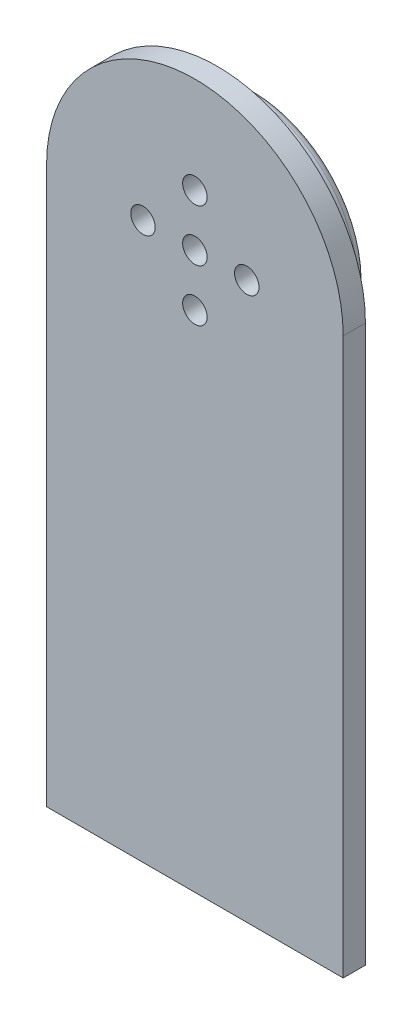
ISO-10303-21;
HEADER;
FILE_DESCRIPTION(('STEP AP214'),'2;1');
FILE_NAME('part.step','',(''),(''),'','','');
FILE_SCHEMA(('AUTOMOTIVE_DESIGN { 1 0 10303 214 1 1 1 1 }'));
ENDSEC;
DATA;
#1=APPLICATION_CONTEXT('core data for automotive mechanical design processes');
#2=APPLICATION_PROTOCOL_DEFINITION('international standard','automotive_design',2000,#1);
#3=PRODUCT_CONTEXT('',#1,'mechanical');
#4=PRODUCT('Part','Part','',(#3));
#5=PRODUCT_RELATED_PRODUCT_CATEGORY('part','',(#4));
#6=PRODUCT_DEFINITION_FORMATION('','',#4);
#7=PRODUCT_DEFINITION_CONTEXT('part definition',#1,'design');
#8=PRODUCT_DEFINITION('design','',#6,#7);
#9=PRODUCT_DEFINITION_SHAPE('','',#8);
#10=(LENGTH_UNIT() NAMED_UNIT(*) SI_UNIT(.MILLI.,.METRE.));
#11=(NAMED_UNIT(*) PLANE_ANGLE_UNIT() SI_UNIT($,.RADIAN.));
#12=(NAMED_UNIT(*) SI_UNIT($,.STERADIAN.) SOLID_ANGLE_UNIT());
#13=UNCERTAINTY_MEASURE_WITH_UNIT(LENGTH_MEASURE(1.E-05),#10,'distance_accuracy_value','');
#14=(GEOMETRIC_REPRESENTATION_CONTEXT(3) GLOBAL_UNCERTAINTY_ASSIGNED_CONTEXT((#13)) GLOBAL_UNIT_ASSIGNED_CONTEXT((#10,
#11,#12)) REPRESENTATION_CONTEXT('',''));
#15=CARTESIAN_POINT('',(0.,0.,0.));
#16=DIRECTION('',(0.,0.,1.));
#17=DIRECTION('',(1.,0.,0.));
#18=AXIS2_PLACEMENT_3D('',#15,#16,#17);
#19=CARTESIAN_POINT('',(0.,0.,8.));
#20=DIRECTION('',(0.,0.,-1.));
#21=DIRECTION('',(-1.,0.,0.));
#22=AXIS2_PLACEMENT_3D('',#19,#20,#21);
#23=CYLINDRICAL_SURFACE('',#22,15.);
#24=CARTESIAN_POINT('',(0.,0.,1.));
#25=DIRECTION('',(0.,0.,1.));
#26=DIRECTION('',(1.,0.,0.));
#27=AXIS2_PLACEMENT_3D('',#24,#25,#26);
#28=CIRCLE('',#27,15.);
#29=CARTESIAN_POINT('',(15.,0.,1.));
#30=VERTEX_POINT('',#29);
#31=EDGE_CURVE('E144',#30,#30,#28,.T.);
#32=ORIENTED_EDGE('',*,*,#31,.T.);
#33=EDGE_LOOP('',(#32));
#34=FACE_BOUND('',#33,.T.);
#35=CARTESIAN_POINT('',(0.,0.,5.));
#36=DIRECTION('',(0.,0.,1.));
#37=DIRECTION('',(1.,0.,0.));
#38=AXIS2_PLACEMENT_3D('',#35,#36,#37);
#39=CIRCLE('',#38,15.);
#40=CARTESIAN_POINT('',(15.,0.,5.));
#41=VERTEX_POINT('',#40);
#42=EDGE_CURVE('E11',#41,#41,#39,.T.);
#43=ORIENTED_EDGE('',*,*,#42,.F.);
#44=EDGE_LOOP('',(#43));
#45=FACE_BOUND('',#44,.T.);
#46=ADVANCED_FACE('F37',(#34,#45),#23,.T.);
#47=CARTESIAN_POINT('',(0.,0.,8.));
#48=DIRECTION('',(0.,0.,1.));
#49=DIRECTION('',(1.,0.,0.));
#50=AXIS2_PLACEMENT_3D('',#47,#48,#49);
#51=PLANE('',#50);
#52=CARTESIAN_POINT('',(3.95332173747447E-13,-7.,8.));
#53=DIRECTION('',(0.,0.,1.));
#54=DIRECTION('',(1.,0.,0.));
#55=AXIS2_PLACEMENT_3D('',#52,#53,#54);
#56=CIRCLE('',#55,1.65000000000043);
#57=CARTESIAN_POINT('',(1.65000000000082,-7.,8.));
#58=VERTEX_POINT('',#57);
#59=EDGE_CURVE('E123',#58,#58,#56,.T.);
#60=ORIENTED_EDGE('',*,*,#59,.F.);
#61=EDGE_LOOP('',(#60));
#62=FACE_BOUND('',#61,.T.);
#63=CARTESIAN_POINT('',(0.,7.,8.));
#64=DIRECTION('',(0.,0.,1.));
#65=DIRECTION('',(1.,0.,0.));
#66=AXIS2_PLACEMENT_3D('',#63,#64,#65);
#67=CIRCLE('',#66,1.65);
#68=CARTESIAN_POINT('',(1.65,7.,8.));
#69=VERTEX_POINT('',#68);
#70=EDGE_CURVE('E135',#69,#69,#67,.T.);
#71=ORIENTED_EDGE('',*,*,#70,.F.);
#72=EDGE_LOOP('',(#71));
#73=FACE_BOUND('',#72,.T.);
#74=CARTESIAN_POINT('',(0.,0.,8.));
#75=DIRECTION('',(0.,0.,1.));
#76=DIRECTION('',(1.,0.,0.));
#77=AXIS2_PLACEMENT_3D('',#74,#75,#76);
#78=CIRCLE('',#77,1.65);
#79=CARTESIAN_POINT('',(1.65,0.,8.));
#80=VERTEX_POINT('',#79);
#81=EDGE_CURVE('E141',#80,#80,#78,.T.);
#82=ORIENTED_EDGE('',*,*,#81,.F.);
#83=EDGE_LOOP('',(#82));
#84=FACE_BOUND('',#83,.T.);
#85=CARTESIAN_POINT('',(7.0000000000002,1.97666086873723E-13,8.));
#86=DIRECTION('',(0.,0.,1.));
#87=DIRECTION('',(1.,0.,0.));
#88=AXIS2_PLACEMENT_3D('',#85,#86,#87);
#89=CIRCLE('',#88,1.65000000000016);
#90=CARTESIAN_POINT('',(8.65000000000035,1.97666086873723E-13,8.));
#91=VERTEX_POINT('',#90);
#92=EDGE_CURVE('E129',#91,#91,#89,.T.);
#93=ORIENTED_EDGE('',*,*,#92,.F.);
#94=EDGE_LOOP('',(#93));
#95=FACE_BOUND('',#94,.T.);
#96=CARTESIAN_POINT('',(-6.9999999999998,-1.98523339633126E-13,8.));
#97=DIRECTION('',(0.,0.,1.));
#98=DIRECTION('',(1.,0.,0.));
#99=AXIS2_PLACEMENT_3D('',#96,#97,#98);
#100=CIRCLE('',#99,1.65000000000032);
#101=CARTESIAN_POINT('',(-5.34999999999949,-1.98523339633126E-13,8.));
#102=VERTEX_POINT('',#101);
#103=EDGE_CURVE('E117',#102,#102,#100,.T.);
#104=ORIENTED_EDGE('',*,*,#103,.F.);
#105=EDGE_LOOP('',(#104));
#106=FACE_BOUND('',#105,.T.);
#107=CARTESIAN_POINT('',(0.,0.,8.));
#108=DIRECTION('',(0.,0.,1.));
#109=DIRECTION('',(1.,0.,0.));
#110=AXIS2_PLACEMENT_3D('',#107,#108,#109);
#111=CIRCLE('',#110,20.);
#112=CARTESIAN_POINT('',(20.,0.,8.));
#113=VERTEX_POINT('',#112);
#114=CARTESIAN_POINT('',(-20.,0.,8.));
#115=VERTEX_POINT('',#114);
#116=EDGE_CURVE('E106',#113,#115,#111,.T.);
#117=ORIENTED_EDGE('',*,*,#116,.T.);
#118=DIRECTION('',(0.,-1.,0.));
#119=VECTOR('',#118,1.);
#120=CARTESIAN_POINT('',(-20.,0.,8.));
#121=LINE('',#120,#119);
#122=CARTESIAN_POINT('',(-20.,-75.,8.));
#123=VERTEX_POINT('',#122);
#124=EDGE_CURVE('E109',#115,#123,#121,.T.);
#125=ORIENTED_EDGE('',*,*,#124,.T.);
#126=DIRECTION('',(1.,0.,0.));
#127=VECTOR('',#126,1.);
#128=CARTESIAN_POINT('',(0.,-75.,8.));
#129=LINE('',#128,#127);
#130=CARTESIAN_POINT('',(20.,-75.,8.));
#131=VERTEX_POINT('',#130);
#132=EDGE_CURVE('E90',#123,#131,#129,.T.);
#133=ORIENTED_EDGE('',*,*,#132,.T.);
#134=DIRECTION('',(0.,-1.,0.));
#135=VECTOR('',#134,1.);
#136=CARTESIAN_POINT('',(20.,0.,8.));
#137=LINE('',#136,#135);
#138=EDGE_CURVE('E102',#113,#131,#137,.T.);
#139=ORIENTED_EDGE('',*,*,#138,.F.);
#140=EDGE_LOOP('',(#117,#125,#133,#139));
#141=FACE_BOUND('',#140,.T.);
#142=ADVANCED_FACE('F162',(#62,#73,#84,#95,#106,#141),#51,.T.);
#143=CARTESIAN_POINT('',(0.,0.,0.));
#144=DIRECTION('',(0.,0.,1.));
#145=DIRECTION('',(1.,0.,0.));
#146=AXIS2_PLACEMENT_3D('',#143,#144,#145);
#147=PLANE('',#146);
#148=CARTESIAN_POINT('',(0.,0.,0.));
#149=DIRECTION('',(0.,0.,1.));
#150=DIRECTION('',(1.,0.,0.));
#151=AXIS2_PLACEMENT_3D('',#148,#149,#150);
#152=CIRCLE('',#151,14.);
#153=CARTESIAN_POINT('',(14.,0.,0.));
#154=VERTEX_POINT('',#153);
#155=EDGE_CURVE('E46',#154,#154,#152,.F.);
#156=ORIENTED_EDGE('',*,*,#155,.T.);
#157=EDGE_LOOP('',(#156));
#158=FACE_BOUND('',#157,.T.);
#159=CARTESIAN_POINT('',(0.,0.,0.));
#160=DIRECTION('',(0.,0.,1.));
#161=DIRECTION('',(1.,0.,0.));
#162=AXIS2_PLACEMENT_3D('',#159,#160,#161);
#163=CIRCLE('',#162,1.65);
#164=CARTESIAN_POINT('',(1.65,0.,0.));
#165=VERTEX_POINT('',#164);
#166=EDGE_CURVE('E138',#165,#165,#163,.T.);
#167=ORIENTED_EDGE('',*,*,#166,.T.);
#168=EDGE_LOOP('',(#167));
#169=FACE_BOUND('',#168,.T.);
#170=CARTESIAN_POINT('',(0.,7.,0.));
#171=DIRECTION('',(0.,0.,1.));
#172=DIRECTION('',(1.,0.,0.));
#173=AXIS2_PLACEMENT_3D('',#170,#171,#172);
#174=CIRCLE('',#173,1.65);
#175=CARTESIAN_POINT('',(1.65,7.,0.));
#176=VERTEX_POINT('',#175);
#177=EDGE_CURVE('E132',#176,#176,#174,.T.);
#178=ORIENTED_EDGE('',*,*,#177,.T.);
#179=EDGE_LOOP('',(#178));
#180=FACE_BOUND('',#179,.T.);
#181=CARTESIAN_POINT('',(7.0000000000002,1.97666086873723E-13,0.));
#182=DIRECTION('',(0.,0.,1.));
#183=DIRECTION('',(1.,0.,0.));
#184=AXIS2_PLACEMENT_3D('',#181,#182,#183);
#185=CIRCLE('',#184,1.65000000000016);
#186=CARTESIAN_POINT('',(8.65000000000035,1.97666086873723E-13,0.));
#187=VERTEX_POINT('',#186);
#188=EDGE_CURVE('E126',#187,#187,#185,.T.);
#189=ORIENTED_EDGE('',*,*,#188,.T.);
#190=EDGE_LOOP('',(#189));
#191=FACE_BOUND('',#190,.T.);
#192=CARTESIAN_POINT('',(3.95332173747447E-13,-7.,0.));
#193=DIRECTION('',(0.,0.,1.));
#194=DIRECTION('',(1.,0.,0.));
#195=AXIS2_PLACEMENT_3D('',#192,#193,#194);
#196=CIRCLE('',#195,1.65000000000043);
#197=CARTESIAN_POINT('',(1.65000000000082,-7.,0.));
#198=VERTEX_POINT('',#197);
#199=EDGE_CURVE('E120',#198,#198,#196,.T.);
#200=ORIENTED_EDGE('',*,*,#199,.T.);
#201=EDGE_LOOP('',(#200));
#202=FACE_BOUND('',#201,.T.);
#203=CARTESIAN_POINT('',(-6.9999999999998,-1.98523339633126E-13,0.));
#204=DIRECTION('',(0.,0.,1.));
#205=DIRECTION('',(1.,0.,0.));
#206=AXIS2_PLACEMENT_3D('',#203,#204,#205);
#207=CIRCLE('',#206,1.65000000000032);
#208=CARTESIAN_POINT('',(-5.34999999999949,-1.98523339633126E-13,0.));
#209=VERTEX_POINT('',#208);
#210=EDGE_CURVE('E114',#209,#209,#207,.T.);
#211=ORIENTED_EDGE('',*,*,#210,.T.);
#212=EDGE_LOOP('',(#211));
#213=FACE_BOUND('',#212,.T.);
#214=ADVANCED_FACE('F151',(#158,#169,#180,#191,#202,#213),#147,.F.);
#215=CARTESIAN_POINT('',(0.,0.,8.));
#216=DIRECTION('',(0.,0.,-1.));
#217=DIRECTION('',(-1.,0.,0.));
#218=AXIS2_PLACEMENT_3D('',#215,#216,#217);
#219=CYLINDRICAL_SURFACE('',#218,1.65);
#220=ORIENTED_EDGE('',*,*,#81,.T.);
#221=EDGE_LOOP('',(#220));
#222=FACE_BOUND('',#221,.T.);
#223=ORIENTED_EDGE('',*,*,#166,.F.);
#224=EDGE_LOOP('',(#223));
#225=FACE_BOUND('',#224,.T.);
#226=ADVANCED_FACE('F193',(#222,#225),#219,.F.);
#227=CARTESIAN_POINT('',(0.,7.,8.));
#228=DIRECTION('',(0.,0.,-1.));
#229=DIRECTION('',(-1.,0.,0.));
#230=AXIS2_PLACEMENT_3D('',#227,#228,#229);
#231=CYLINDRICAL_SURFACE('',#230,1.65);
#232=ORIENTED_EDGE('',*,*,#70,.T.);
#233=EDGE_LOOP('',(#232));
#234=FACE_BOUND('',#233,.T.);
#235=ORIENTED_EDGE('',*,*,#177,.F.);
#236=EDGE_LOOP('',(#235));
#237=FACE_BOUND('',#236,.T.);
#238=ADVANCED_FACE('F189',(#234,#237),#231,.F.);
#239=CARTESIAN_POINT('',(7.0000000000002,1.97666086873723E-13,8.));
#240=DIRECTION('',(0.,0.,-1.));
#241=DIRECTION('',(-1.,0.,0.));
#242=AXIS2_PLACEMENT_3D('',#239,#240,#241);
#243=CYLINDRICAL_SURFACE('',#242,1.65000000000016);
#244=ORIENTED_EDGE('',*,*,#92,.T.);
#245=EDGE_LOOP('',(#244));
#246=FACE_BOUND('',#245,.T.);
#247=ORIENTED_EDGE('',*,*,#188,.F.);
#248=EDGE_LOOP('',(#247));
#249=FACE_BOUND('',#248,.T.);
#250=ADVANCED_FACE('F185',(#246,#249),#243,.F.);
#251=CARTESIAN_POINT('',(3.95332173747447E-13,-7.,8.));
#252=DIRECTION('',(0.,0.,-1.));
#253=DIRECTION('',(-1.,0.,0.));
#254=AXIS2_PLACEMENT_3D('',#251,#252,#253);
#255=CYLINDRICAL_SURFACE('',#254,1.65000000000043);
#256=ORIENTED_EDGE('',*,*,#59,.T.);
#257=EDGE_LOOP('',(#256));
#258=FACE_BOUND('',#257,.T.);
#259=ORIENTED_EDGE('',*,*,#199,.F.);
#260=EDGE_LOOP('',(#259));
#261=FACE_BOUND('',#260,.T.);
#262=ADVANCED_FACE('F181',(#258,#261),#255,.F.);
#263=CARTESIAN_POINT('',(-6.9999999999998,-1.98523339633126E-13,8.));
#264=DIRECTION('',(0.,0.,-1.));
#265=DIRECTION('',(-1.,0.,0.));
#266=AXIS2_PLACEMENT_3D('',#263,#264,#265);
#267=CYLINDRICAL_SURFACE('',#266,1.65000000000032);
#268=ORIENTED_EDGE('',*,*,#103,.T.);
#269=EDGE_LOOP('',(#268));
#270=FACE_BOUND('',#269,.T.);
#271=ORIENTED_EDGE('',*,*,#210,.F.);
#272=EDGE_LOOP('',(#271));
#273=FACE_BOUND('',#272,.T.);
#274=ADVANCED_FACE('F157',(#270,#273),#267,.F.);
#275=CARTESIAN_POINT('',(0.,0.,1.));
#276=DIRECTION('',(0.,0.,1.));
#277=DIRECTION('',(1.,0.,0.));
#278=AXIS2_PLACEMENT_3D('',#275,#276,#277);
#279=TOROIDAL_SURFACE('',#278,14.,1.);
#280=ORIENTED_EDGE('',*,*,#155,.F.);
#281=EDGE_LOOP('',(#280));
#282=FACE_BOUND('',#281,.T.);
#283=ORIENTED_EDGE('',*,*,#31,.F.);
#284=EDGE_LOOP('',(#283));
#285=FACE_BOUND('',#284,.T.);
#286=ADVANCED_FACE('F39',(#282,#285),#279,.T.);
#287=CARTESIAN_POINT('',(0.,0.,5.));
#288=DIRECTION('',(0.,0.,1.));
#289=DIRECTION('',(1.,0.,0.));
#290=AXIS2_PLACEMENT_3D('',#287,#288,#289);
#291=CYLINDRICAL_SURFACE('',#290,20.);
#292=ORIENTED_EDGE('',*,*,#116,.F.);
#293=DIRECTION('',(0.,0.,1.));
#294=VECTOR('',#293,1.);
#295=CARTESIAN_POINT('',(20.,0.,5.));
#296=LINE('',#295,#294);
#297=CARTESIAN_POINT('',(20.,0.,5.));
#298=VERTEX_POINT('',#297);
#299=EDGE_CURVE('E54',#298,#113,#296,.T.);
#300=ORIENTED_EDGE('',*,*,#299,.F.);
#301=CARTESIAN_POINT('',(0.,0.,5.));
#302=DIRECTION('',(0.,0.,1.));
#303=DIRECTION('',(1.,0.,0.));
#304=AXIS2_PLACEMENT_3D('',#301,#302,#303);
#305=CIRCLE('',#304,20.);
#306=CARTESIAN_POINT('',(-20.,0.,5.));
#307=VERTEX_POINT('',#306);
#308=EDGE_CURVE('E100',#298,#307,#305,.T.);
#309=ORIENTED_EDGE('',*,*,#308,.T.);
#310=DIRECTION('',(0.,0.,1.));
#311=VECTOR('',#310,1.);
#312=CARTESIAN_POINT('',(-20.,0.,5.));
#313=LINE('',#312,#311);
#314=EDGE_CURVE('E82',#307,#115,#313,.T.);
#315=ORIENTED_EDGE('',*,*,#314,.T.);
#316=EDGE_LOOP('',(#292,#300,#309,#315));
#317=FACE_BOUND('',#316,.T.);
#318=ADVANCED_FACE('F156',(#317),#291,.T.);
#319=CARTESIAN_POINT('',(20.,0.,5.));
#320=DIRECTION('',(-1.,0.,0.));
#321=DIRECTION('',(0.,0.,1.));
#322=AXIS2_PLACEMENT_3D('',#319,#320,#321);
#323=PLANE('',#322);
#324=ORIENTED_EDGE('',*,*,#138,.T.);
#325=DIRECTION('',(0.,0.,1.));
#326=VECTOR('',#325,1.);
#327=CARTESIAN_POINT('',(20.,-75.,5.));
#328=LINE('',#327,#326);
#329=CARTESIAN_POINT('',(20.,-75.,5.));
#330=VERTEX_POINT('',#329);
#331=EDGE_CURVE('E72',#330,#131,#328,.T.);
#332=ORIENTED_EDGE('',*,*,#331,.F.);
#333=DIRECTION('',(0.,-1.,0.));
#334=VECTOR('',#333,1.);
#335=CARTESIAN_POINT('',(20.,0.,5.));
#336=LINE('',#335,#334);
#337=EDGE_CURVE('E97',#298,#330,#336,.T.);
#338=ORIENTED_EDGE('',*,*,#337,.F.);
#339=ORIENTED_EDGE('',*,*,#299,.T.);
#340=EDGE_LOOP('',(#324,#332,#338,#339));
#341=FACE_BOUND('',#340,.T.);
#342=ADVANCED_FACE('F172',(#341),#323,.F.);
#343=CARTESIAN_POINT('',(0.,-75.,5.));
#344=DIRECTION('',(0.,-1.,0.));
#345=DIRECTION('',(0.,0.,-1.));
#346=AXIS2_PLACEMENT_3D('',#343,#344,#345);
#347=PLANE('',#346);
#348=ORIENTED_EDGE('',*,*,#132,.F.);
#349=DIRECTION('',(0.,0.,1.));
#350=VECTOR('',#349,1.);
#351=CARTESIAN_POINT('',(-20.,-75.,5.));
#352=LINE('',#351,#350);
#353=CARTESIAN_POINT('',(-20.,-75.,5.));
#354=VERTEX_POINT('',#353);
#355=EDGE_CURVE('E85',#354,#123,#352,.T.);
#356=ORIENTED_EDGE('',*,*,#355,.F.);
#357=DIRECTION('',(1.,0.,0.));
#358=VECTOR('',#357,1.);
#359=CARTESIAN_POINT('',(0.,-75.,5.));
#360=LINE('',#359,#358);
#361=EDGE_CURVE('E88',#354,#330,#360,.T.);
#362=ORIENTED_EDGE('',*,*,#361,.T.);
#363=ORIENTED_EDGE('',*,*,#331,.T.);
#364=EDGE_LOOP('',(#348,#356,#362,#363));
#365=FACE_BOUND('',#364,.T.);
#366=ADVANCED_FACE('F87',(#365),#347,.T.);
#367=CARTESIAN_POINT('',(-20.,0.,5.));
#368=DIRECTION('',(-1.,0.,0.));
#369=DIRECTION('',(0.,-1.,0.));
#370=AXIS2_PLACEMENT_3D('',#367,#368,#369);
#371=PLANE('',#370);
#372=ORIENTED_EDGE('',*,*,#124,.F.);
#373=ORIENTED_EDGE('',*,*,#314,.F.);
#374=DIRECTION('',(0.,-1.,0.));
#375=VECTOR('',#374,1.);
#376=CARTESIAN_POINT('',(-20.,0.,5.));
#377=LINE('',#376,#375);
#378=EDGE_CURVE('E96',#307,#354,#377,.T.);
#379=ORIENTED_EDGE('',*,*,#378,.T.);
#380=ORIENTED_EDGE('',*,*,#355,.T.);
#381=EDGE_LOOP('',(#372,#373,#379,#380));
#382=FACE_BOUND('',#381,.T.);
#383=ADVANCED_FACE('F99',(#382),#371,.T.);
#384=CARTESIAN_POINT('',(0.,0.,5.));
#385=DIRECTION('',(0.,0.,1.));
#386=DIRECTION('',(1.,0.,0.));
#387=AXIS2_PLACEMENT_3D('',#384,#385,#386);
#388=PLANE('',#387);
#389=ORIENTED_EDGE('',*,*,#42,.T.);
#390=EDGE_LOOP('',(#389));
#391=FACE_BOUND('',#390,.T.);
#392=ORIENTED_EDGE('',*,*,#308,.F.);
#393=ORIENTED_EDGE('',*,*,#337,.T.);
#394=ORIENTED_EDGE('',*,*,#361,.F.);
#395=ORIENTED_EDGE('',*,*,#378,.F.);
#396=EDGE_LOOP('',(#392,#393,#394,#395));
#397=FACE_BOUND('',#396,.T.);
#398=ADVANCED_FACE('F95',(#391,#397),#388,.F.);
#399=CLOSED_SHELL('',(#46,#142,#214,#226,#238,#250,#262,#274,#286,#318,#342,#366,#383,#398));
#400=MANIFOLD_SOLID_BREP('B2',#399);
#401=ADVANCED_BREP_SHAPE_REPRESENTATION('',(#18,#400),#14);
#402=SHAPE_DEFINITION_REPRESENTATION(#9,#401);
ENDSEC;
END-ISO-10303-21;
